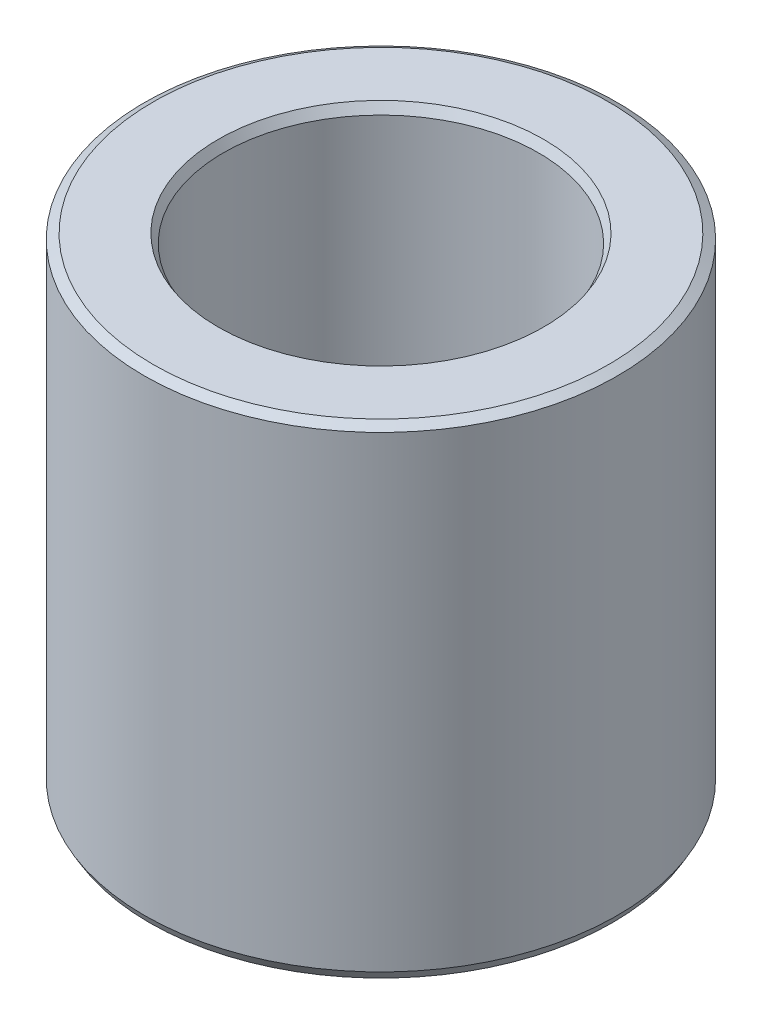
ISO-10303-21;
HEADER;
FILE_DESCRIPTION(('STEP AP214'),'2;1');
FILE_NAME('part.step','',(''),(''),'','','');
FILE_SCHEMA(('AUTOMOTIVE_DESIGN { 1 0 10303 214 1 1 1 1 }'));
ENDSEC;
DATA;
#1=APPLICATION_CONTEXT('core data for automotive mechanical design processes');
#2=APPLICATION_PROTOCOL_DEFINITION('international standard','automotive_design',2000,#1);
#3=PRODUCT_CONTEXT('',#1,'mechanical');
#4=PRODUCT('Part','Part','',(#3));
#5=PRODUCT_RELATED_PRODUCT_CATEGORY('part','',(#4));
#6=PRODUCT_DEFINITION_FORMATION('','',#4);
#7=PRODUCT_DEFINITION_CONTEXT('part definition',#1,'design');
#8=PRODUCT_DEFINITION('design','',#6,#7);
#9=PRODUCT_DEFINITION_SHAPE('','',#8);
#10=(LENGTH_UNIT() NAMED_UNIT(*) SI_UNIT(.MILLI.,.METRE.));
#11=(NAMED_UNIT(*) PLANE_ANGLE_UNIT() SI_UNIT($,.RADIAN.));
#12=(NAMED_UNIT(*) SI_UNIT($,.STERADIAN.) SOLID_ANGLE_UNIT());
#13=UNCERTAINTY_MEASURE_WITH_UNIT(LENGTH_MEASURE(1.E-05),#10,'distance_accuracy_value','');
#14=(GEOMETRIC_REPRESENTATION_CONTEXT(3) GLOBAL_UNCERTAINTY_ASSIGNED_CONTEXT((#13)) GLOBAL_UNIT_ASSIGNED_CONTEXT((#10,
#11,#12)) REPRESENTATION_CONTEXT('',''));
#15=CARTESIAN_POINT('',(0.,0.,0.));
#16=DIRECTION('',(0.,0.,1.));
#17=DIRECTION('',(1.,0.,0.));
#18=AXIS2_PLACEMENT_3D('',#15,#16,#17);
#19=CARTESIAN_POINT('',(0.,66.1181204349753,0.));
#20=DIRECTION('',(0.,-1.,0.));
#21=DIRECTION('',(0.,0.,-1.));
#22=AXIS2_PLACEMENT_3D('',#19,#20,#21);
#23=CYLINDRICAL_SURFACE('',#22,32.5);
#24=CARTESIAN_POINT('',(0.,1.23933992177838,0.));
#25=DIRECTION('',(0.,1.,0.));
#26=DIRECTION('',(0.,0.,1.));
#27=AXIS2_PLACEMENT_3D('',#24,#25,#26);
#28=CIRCLE('',#27,32.5);
#29=CARTESIAN_POINT('',(0.,1.23933992177838,32.5));
#30=VERTEX_POINT('',#29);
#31=EDGE_CURVE('E10',#30,#30,#28,.T.);
#32=ORIENTED_EDGE('',*,*,#31,.T.);
#33=EDGE_LOOP('',(#32));
#34=FACE_BOUND('',#33,.T.);
#35=CARTESIAN_POINT('',(0.,65.402587197519,0.));
#36=DIRECTION('',(0.,1.,0.));
#37=DIRECTION('',(0.,0.,1.));
#38=AXIS2_PLACEMENT_3D('',#35,#36,#37);
#39=CIRCLE('',#38,32.5);
#40=CARTESIAN_POINT('',(0.,65.402587197519,32.5));
#41=VERTEX_POINT('',#40);
#42=EDGE_CURVE('E50',#41,#41,#39,.F.);
#43=ORIENTED_EDGE('',*,*,#42,.T.);
#44=EDGE_LOOP('',(#43));
#45=FACE_BOUND('',#44,.T.);
#46=ADVANCED_FACE('F39',(#34,#45),#23,.T.);
#47=CARTESIAN_POINT('',(0.,66.1181204349753,0.));
#48=DIRECTION('',(0.,1.,0.));
#49=DIRECTION('',(0.,0.,1.));
#50=AXIS2_PLACEMENT_3D('',#47,#48,#49);
#51=PLANE('',#50);
#52=CARTESIAN_POINT('',(0.,66.1181204349753,0.));
#53=DIRECTION('',(0.,1.,0.));
#54=DIRECTION('',(0.,0.,1.));
#55=AXIS2_PLACEMENT_3D('',#52,#53,#54);
#56=CIRCLE('',#55,22.3437760823972);
#57=CARTESIAN_POINT('',(0.,66.1181204349753,22.3437760823972));
#58=VERTEX_POINT('',#57);
#59=EDGE_CURVE('E58',#58,#58,#56,.F.);
#60=ORIENTED_EDGE('',*,*,#59,.T.);
#61=EDGE_LOOP('',(#60));
#62=FACE_BOUND('',#61,.T.);
#63=CARTESIAN_POINT('',(0.,66.1181204349753,0.));
#64=DIRECTION('',(0.,1.,0.));
#65=DIRECTION('',(0.,0.,1.));
#66=AXIS2_PLACEMENT_3D('',#63,#64,#65);
#67=CIRCLE('',#66,31.2606600782216);
#68=CARTESIAN_POINT('',(0.,66.1181204349753,31.2606600782216));
#69=VERTEX_POINT('',#68);
#70=EDGE_CURVE('E61',#69,#69,#67,.T.);
#71=ORIENTED_EDGE('',*,*,#70,.T.);
#72=EDGE_LOOP('',(#71));
#73=FACE_BOUND('',#72,.T.);
#74=ADVANCED_FACE('F88',(#62,#73),#51,.T.);
#75=CARTESIAN_POINT('',(0.,0.,0.));
#76=DIRECTION('',(0.,1.,0.));
#77=DIRECTION('',(0.,0.,1.));
#78=AXIS2_PLACEMENT_3D('',#75,#76,#77);
#79=PLANE('',#78);
#80=CARTESIAN_POINT('',(0.,0.,0.));
#81=DIRECTION('',(0.,1.,0.));
#82=DIRECTION('',(0.,0.,1.));
#83=AXIS2_PLACEMENT_3D('',#80,#81,#82);
#84=CIRCLE('',#83,22.8675827667194);
#85=CARTESIAN_POINT('',(0.,0.,22.8675827667194));
#86=VERTEX_POINT('',#85);
#87=EDGE_CURVE('E51',#86,#86,#84,.T.);
#88=ORIENTED_EDGE('',*,*,#87,.T.);
#89=EDGE_LOOP('',(#88));
#90=FACE_BOUND('',#89,.T.);
#91=CARTESIAN_POINT('',(0.,0.,0.));
#92=DIRECTION('',(0.,1.,0.));
#93=DIRECTION('',(0.,0.,1.));
#94=AXIS2_PLACEMENT_3D('',#91,#92,#93);
#95=CIRCLE('',#94,31.7844667625438);
#96=CARTESIAN_POINT('',(0.,0.,31.7844667625438));
#97=VERTEX_POINT('',#96);
#98=EDGE_CURVE('E54',#97,#97,#95,.F.);
#99=ORIENTED_EDGE('',*,*,#98,.T.);
#100=EDGE_LOOP('',(#99));
#101=FACE_BOUND('',#100,.T.);
#102=ADVANCED_FACE('F83',(#90,#101),#79,.F.);
#103=CARTESIAN_POINT('',(0.,66.1181204349753,0.));
#104=DIRECTION('',(0.,-1.,0.));
#105=DIRECTION('',(0.,0.,-1.));
#106=AXIS2_PLACEMENT_3D('',#103,#104,#105);
#107=CYLINDRICAL_SURFACE('',#106,21.6282428449411);
#108=CARTESIAN_POINT('',(0.,64.8787805131969,0.));
#109=DIRECTION('',(0.,1.,0.));
#110=DIRECTION('',(0.,0.,1.));
#111=AXIS2_PLACEMENT_3D('',#108,#109,#110);
#112=CIRCLE('',#111,21.6282428449411);
#113=CARTESIAN_POINT('',(0.,64.8787805131969,21.6282428449411));
#114=VERTEX_POINT('',#113);
#115=EDGE_CURVE('E67',#114,#114,#112,.T.);
#116=ORIENTED_EDGE('',*,*,#115,.T.);
#117=EDGE_LOOP('',(#116));
#118=FACE_BOUND('',#117,.T.);
#119=CARTESIAN_POINT('',(0.,0.715533237456212,0.));
#120=DIRECTION('',(0.,1.,0.));
#121=DIRECTION('',(0.,0.,1.));
#122=AXIS2_PLACEMENT_3D('',#119,#120,#121);
#123=CIRCLE('',#122,21.6282428449411);
#124=CARTESIAN_POINT('',(0.,0.715533237456212,21.6282428449411));
#125=VERTEX_POINT('',#124);
#126=EDGE_CURVE('E69',#125,#125,#123,.F.);
#127=ORIENTED_EDGE('',*,*,#126,.T.);
#128=EDGE_LOOP('',(#127));
#129=FACE_BOUND('',#128,.T.);
#130=ADVANCED_FACE('F71',(#118,#129),#107,.F.);
#131=CARTESIAN_POINT('',(0.,64.8787805131969,0.));
#132=DIRECTION('',(0.,1.,0.));
#133=DIRECTION('',(0.,0.,1.));
#134=AXIS2_PLACEMENT_3D('',#131,#132,#133);
#135=CONICAL_SURFACE('',#134,21.6282428449411,0.523598775598293);
#136=ORIENTED_EDGE('',*,*,#59,.F.);
#137=EDGE_LOOP('',(#136));
#138=FACE_BOUND('',#137,.T.);
#139=ORIENTED_EDGE('',*,*,#115,.F.);
#140=EDGE_LOOP('',(#139));
#141=FACE_BOUND('',#140,.T.);
#142=ADVANCED_FACE('F77',(#138,#141),#135,.F.);
#143=CARTESIAN_POINT('',(0.,0.,0.));
#144=DIRECTION('',(0.,-1.,0.));
#145=DIRECTION('',(0.,0.,-1.));
#146=AXIS2_PLACEMENT_3D('',#143,#144,#145);
#147=CONICAL_SURFACE('',#146,22.8675827667194,1.04719755119659);
#148=ORIENTED_EDGE('',*,*,#126,.F.);
#149=EDGE_LOOP('',(#148));
#150=FACE_BOUND('',#149,.T.);
#151=ORIENTED_EDGE('',*,*,#87,.F.);
#152=EDGE_LOOP('',(#151));
#153=FACE_BOUND('',#152,.T.);
#154=ADVANCED_FACE('F73',(#150,#153),#147,.F.);
#155=CARTESIAN_POINT('',(0.,1.23933992177838,0.));
#156=DIRECTION('',(0.,1.,0.));
#157=DIRECTION('',(0.,0.,1.));
#158=AXIS2_PLACEMENT_3D('',#155,#156,#157);
#159=CONICAL_SURFACE('',#158,32.5,0.523598775598303);
#160=ORIENTED_EDGE('',*,*,#98,.F.);
#161=EDGE_LOOP('',(#160));
#162=FACE_BOUND('',#161,.T.);
#163=ORIENTED_EDGE('',*,*,#31,.F.);
#164=EDGE_LOOP('',(#163));
#165=FACE_BOUND('',#164,.T.);
#166=ADVANCED_FACE('F76',(#162,#165),#159,.T.);
#167=CARTESIAN_POINT('',(0.,66.1181204349753,0.));
#168=DIRECTION('',(0.,-1.,0.));
#169=DIRECTION('',(0.,0.,-1.));
#170=AXIS2_PLACEMENT_3D('',#167,#168,#169);
#171=CONICAL_SURFACE('',#170,31.2606600782216,1.04719755119659);
#172=ORIENTED_EDGE('',*,*,#42,.F.);
#173=EDGE_LOOP('',(#172));
#174=FACE_BOUND('',#173,.T.);
#175=ORIENTED_EDGE('',*,*,#70,.F.);
#176=EDGE_LOOP('',(#175));
#177=FACE_BOUND('',#176,.T.);
#178=ADVANCED_FACE('F45',(#174,#177),#171,.T.);
#179=CLOSED_SHELL('',(#46,#74,#102,#130,#142,#154,#166,#178));
#180=MANIFOLD_SOLID_BREP('B2',#179);
#181=ADVANCED_BREP_SHAPE_REPRESENTATION('',(#18,#180),#14);
#182=SHAPE_DEFINITION_REPRESENTATION(#9,#181);
ENDSEC;
END-ISO-10303-21;
